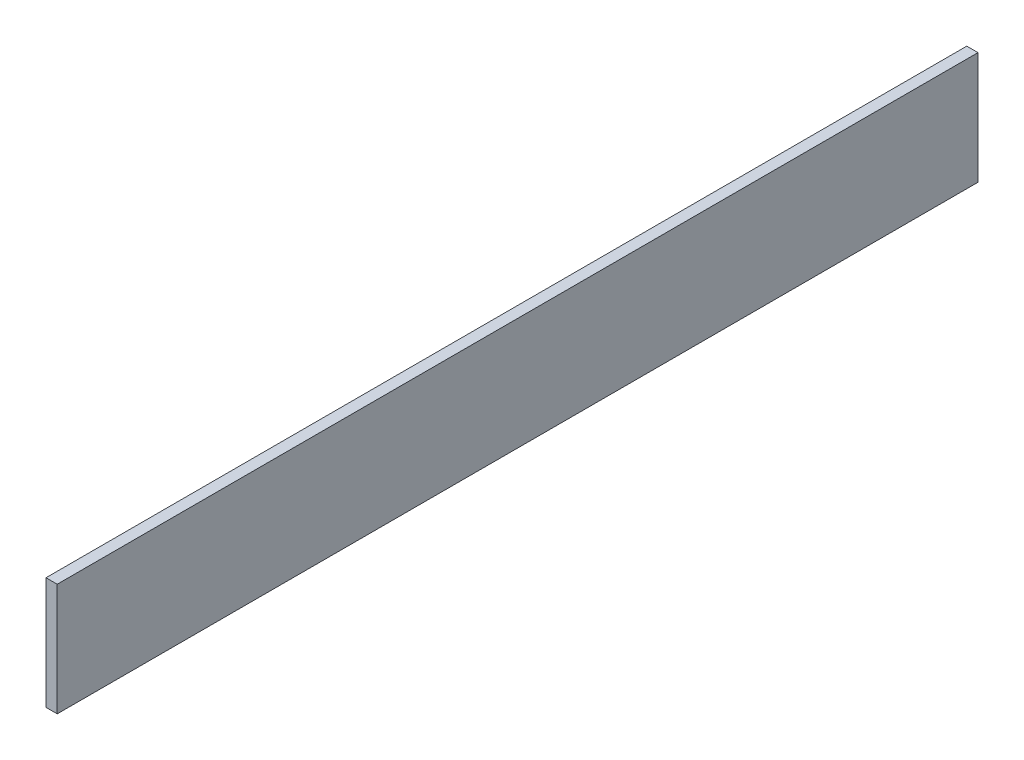
ISO-10303-21;
HEADER;
FILE_DESCRIPTION(('STEP AP214'),'2;1');
FILE_NAME('part.step','',(''),(''),'','','');
FILE_SCHEMA(('AUTOMOTIVE_DESIGN { 1 0 10303 214 1 1 1 1 }'));
ENDSEC;
DATA;
#1=APPLICATION_CONTEXT('core data for automotive mechanical design processes');
#2=APPLICATION_PROTOCOL_DEFINITION('international standard','automotive_design',2000,#1);
#3=PRODUCT_CONTEXT('',#1,'mechanical');
#4=PRODUCT('Part','Part','',(#3));
#5=PRODUCT_RELATED_PRODUCT_CATEGORY('part','',(#4));
#6=PRODUCT_DEFINITION_FORMATION('','',#4);
#7=PRODUCT_DEFINITION_CONTEXT('part definition',#1,'design');
#8=PRODUCT_DEFINITION('design','',#6,#7);
#9=PRODUCT_DEFINITION_SHAPE('','',#8);
#10=(LENGTH_UNIT() NAMED_UNIT(*) SI_UNIT(.MILLI.,.METRE.));
#11=(NAMED_UNIT(*) PLANE_ANGLE_UNIT() SI_UNIT($,.RADIAN.));
#12=(NAMED_UNIT(*) SI_UNIT($,.STERADIAN.) SOLID_ANGLE_UNIT());
#13=UNCERTAINTY_MEASURE_WITH_UNIT(LENGTH_MEASURE(1.E-05),#10,'distance_accuracy_value','');
#14=(GEOMETRIC_REPRESENTATION_CONTEXT(3) GLOBAL_UNCERTAINTY_ASSIGNED_CONTEXT((#13)) GLOBAL_UNIT_ASSIGNED_CONTEXT((#10,
#11,#12)) REPRESENTATION_CONTEXT('',''));
#15=CARTESIAN_POINT('',(0.,0.,0.));
#16=DIRECTION('',(0.,0.,1.));
#17=DIRECTION('',(1.,0.,0.));
#18=AXIS2_PLACEMENT_3D('',#15,#16,#17);
#19=CARTESIAN_POINT('',(-5.,0.,410.));
#20=DIRECTION('',(0.,1.,0.));
#21=DIRECTION('',(0.,0.,1.));
#22=AXIS2_PLACEMENT_3D('',#19,#20,#21);
#23=PLANE('',#22);
#24=DIRECTION('',(1.,0.,0.));
#25=VECTOR('',#24,1.);
#26=CARTESIAN_POINT('',(-5.,0.,0.));
#27=LINE('',#26,#25);
#28=CARTESIAN_POINT('',(-5.,0.,0.));
#29=VERTEX_POINT('',#28);
#30=CARTESIAN_POINT('',(0.,0.,0.));
#31=VERTEX_POINT('',#30);
#32=EDGE_CURVE('E107',#29,#31,#27,.T.);
#33=ORIENTED_EDGE('',*,*,#32,.T.);
#34=DIRECTION('',(0.,0.,-1.));
#35=VECTOR('',#34,1.);
#36=CARTESIAN_POINT('',(0.,0.,410.));
#37=LINE('',#36,#35);
#38=CARTESIAN_POINT('',(0.,0.,410.));
#39=VERTEX_POINT('',#38);
#40=EDGE_CURVE('E11',#39,#31,#37,.T.);
#41=ORIENTED_EDGE('',*,*,#40,.F.);
#42=DIRECTION('',(1.,0.,0.));
#43=VECTOR('',#42,1.);
#44=CARTESIAN_POINT('',(-5.,0.,410.));
#45=LINE('',#44,#43);
#46=CARTESIAN_POINT('',(-5.,0.,410.));
#47=VERTEX_POINT('',#46);
#48=EDGE_CURVE('E91',#47,#39,#45,.T.);
#49=ORIENTED_EDGE('',*,*,#48,.F.);
#50=DIRECTION('',(0.,0.,-1.));
#51=VECTOR('',#50,1.);
#52=CARTESIAN_POINT('',(-5.,0.,410.));
#53=LINE('',#52,#51);
#54=EDGE_CURVE('E103',#47,#29,#53,.T.);
#55=ORIENTED_EDGE('',*,*,#54,.T.);
#56=EDGE_LOOP('',(#33,#41,#49,#55));
#57=FACE_BOUND('',#56,.T.);
#58=ADVANCED_FACE('F39',(#57),#23,.F.);
#59=CARTESIAN_POINT('',(0.,0.,410.));
#60=DIRECTION('',(-1.,0.,0.));
#61=DIRECTION('',(0.,-1.,0.));
#62=AXIS2_PLACEMENT_3D('',#59,#60,#61);
#63=PLANE('',#62);
#64=DIRECTION('',(0.,1.,0.));
#65=VECTOR('',#64,1.);
#66=CARTESIAN_POINT('',(0.,0.,0.));
#67=LINE('',#66,#65);
#68=CARTESIAN_POINT('',(0.,50.,0.));
#69=VERTEX_POINT('',#68);
#70=EDGE_CURVE('E96',#31,#69,#67,.T.);
#71=ORIENTED_EDGE('',*,*,#70,.T.);
#72=DIRECTION('',(0.,0.,-1.));
#73=VECTOR('',#72,1.);
#74=CARTESIAN_POINT('',(0.,50.,410.));
#75=LINE('',#74,#73);
#76=CARTESIAN_POINT('',(0.,50.,410.));
#77=VERTEX_POINT('',#76);
#78=EDGE_CURVE('E48',#77,#69,#75,.T.);
#79=ORIENTED_EDGE('',*,*,#78,.F.);
#80=DIRECTION('',(0.,1.,0.));
#81=VECTOR('',#80,1.);
#82=CARTESIAN_POINT('',(0.,0.,410.));
#83=LINE('',#82,#81);
#84=EDGE_CURVE('E86',#39,#77,#83,.T.);
#85=ORIENTED_EDGE('',*,*,#84,.F.);
#86=ORIENTED_EDGE('',*,*,#40,.T.);
#87=EDGE_LOOP('',(#71,#79,#85,#86));
#88=FACE_BOUND('',#87,.T.);
#89=ADVANCED_FACE('F95',(#88),#63,.F.);
#90=CARTESIAN_POINT('',(0.,50.,410.));
#91=DIRECTION('',(0.,-1.,0.));
#92=DIRECTION('',(0.,0.,-1.));
#93=AXIS2_PLACEMENT_3D('',#90,#91,#92);
#94=PLANE('',#93);
#95=DIRECTION('',(-1.,0.,0.));
#96=VECTOR('',#95,1.);
#97=CARTESIAN_POINT('',(0.,50.,0.));
#98=LINE('',#97,#96);
#99=CARTESIAN_POINT('',(-5.,50.,0.));
#100=VERTEX_POINT('',#99);
#101=EDGE_CURVE('E73',#69,#100,#98,.T.);
#102=ORIENTED_EDGE('',*,*,#101,.T.);
#103=DIRECTION('',(0.,0.,-1.));
#104=VECTOR('',#103,1.);
#105=CARTESIAN_POINT('',(-5.,50.,410.));
#106=LINE('',#105,#104);
#107=CARTESIAN_POINT('',(-5.,50.,410.));
#108=VERTEX_POINT('',#107);
#109=EDGE_CURVE('E98',#108,#100,#106,.T.);
#110=ORIENTED_EDGE('',*,*,#109,.F.);
#111=DIRECTION('',(-1.,0.,0.));
#112=VECTOR('',#111,1.);
#113=CARTESIAN_POINT('',(0.,50.,410.));
#114=LINE('',#113,#112);
#115=EDGE_CURVE('E89',#77,#108,#114,.T.);
#116=ORIENTED_EDGE('',*,*,#115,.F.);
#117=ORIENTED_EDGE('',*,*,#78,.T.);
#118=EDGE_LOOP('',(#102,#110,#116,#117));
#119=FACE_BOUND('',#118,.T.);
#120=ADVANCED_FACE('F99',(#119),#94,.F.);
#121=CARTESIAN_POINT('',(-5.,50.,410.));
#122=DIRECTION('',(1.,0.,0.));
#123=DIRECTION('',(0.,0.,-1.));
#124=AXIS2_PLACEMENT_3D('',#121,#122,#123);
#125=PLANE('',#124);
#126=DIRECTION('',(0.,-1.,0.));
#127=VECTOR('',#126,1.);
#128=CARTESIAN_POINT('',(-5.,50.,0.));
#129=LINE('',#128,#127);
#130=EDGE_CURVE('E79',#100,#29,#129,.T.);
#131=ORIENTED_EDGE('',*,*,#130,.T.);
#132=ORIENTED_EDGE('',*,*,#54,.F.);
#133=DIRECTION('',(0.,-1.,0.));
#134=VECTOR('',#133,1.);
#135=CARTESIAN_POINT('',(-5.,50.,410.));
#136=LINE('',#135,#134);
#137=EDGE_CURVE('E56',#108,#47,#136,.T.);
#138=ORIENTED_EDGE('',*,*,#137,.F.);
#139=ORIENTED_EDGE('',*,*,#109,.T.);
#140=EDGE_LOOP('',(#131,#132,#138,#139));
#141=FACE_BOUND('',#140,.T.);
#142=ADVANCED_FACE('F120',(#141),#125,.F.);
#143=CARTESIAN_POINT('',(0.,0.,410.));
#144=DIRECTION('',(0.,0.,1.));
#145=DIRECTION('',(1.,0.,0.));
#146=AXIS2_PLACEMENT_3D('',#143,#144,#145);
#147=PLANE('',#146);
#148=ORIENTED_EDGE('',*,*,#48,.T.);
#149=ORIENTED_EDGE('',*,*,#84,.T.);
#150=ORIENTED_EDGE('',*,*,#115,.T.);
#151=ORIENTED_EDGE('',*,*,#137,.T.);
#152=EDGE_LOOP('',(#148,#149,#150,#151));
#153=FACE_BOUND('',#152,.T.);
#154=ADVANCED_FACE('F87',(#153),#147,.T.);
#155=CARTESIAN_POINT('',(0.,0.,0.));
#156=DIRECTION('',(0.,0.,1.));
#157=DIRECTION('',(1.,0.,0.));
#158=AXIS2_PLACEMENT_3D('',#155,#156,#157);
#159=PLANE('',#158);
#160=ORIENTED_EDGE('',*,*,#32,.F.);
#161=ORIENTED_EDGE('',*,*,#130,.F.);
#162=ORIENTED_EDGE('',*,*,#101,.F.);
#163=ORIENTED_EDGE('',*,*,#70,.F.);
#164=EDGE_LOOP('',(#160,#161,#162,#163));
#165=FACE_BOUND('',#164,.T.);
#166=ADVANCED_FACE('F123',(#165),#159,.F.);
#167=CLOSED_SHELL('',(#58,#89,#120,#142,#154,#166));
#168=MANIFOLD_SOLID_BREP('B2',#167);
#169=ADVANCED_BREP_SHAPE_REPRESENTATION('',(#18,#168),#14);
#170=SHAPE_DEFINITION_REPRESENTATION(#9,#169);
ENDSEC;
END-ISO-10303-21;
